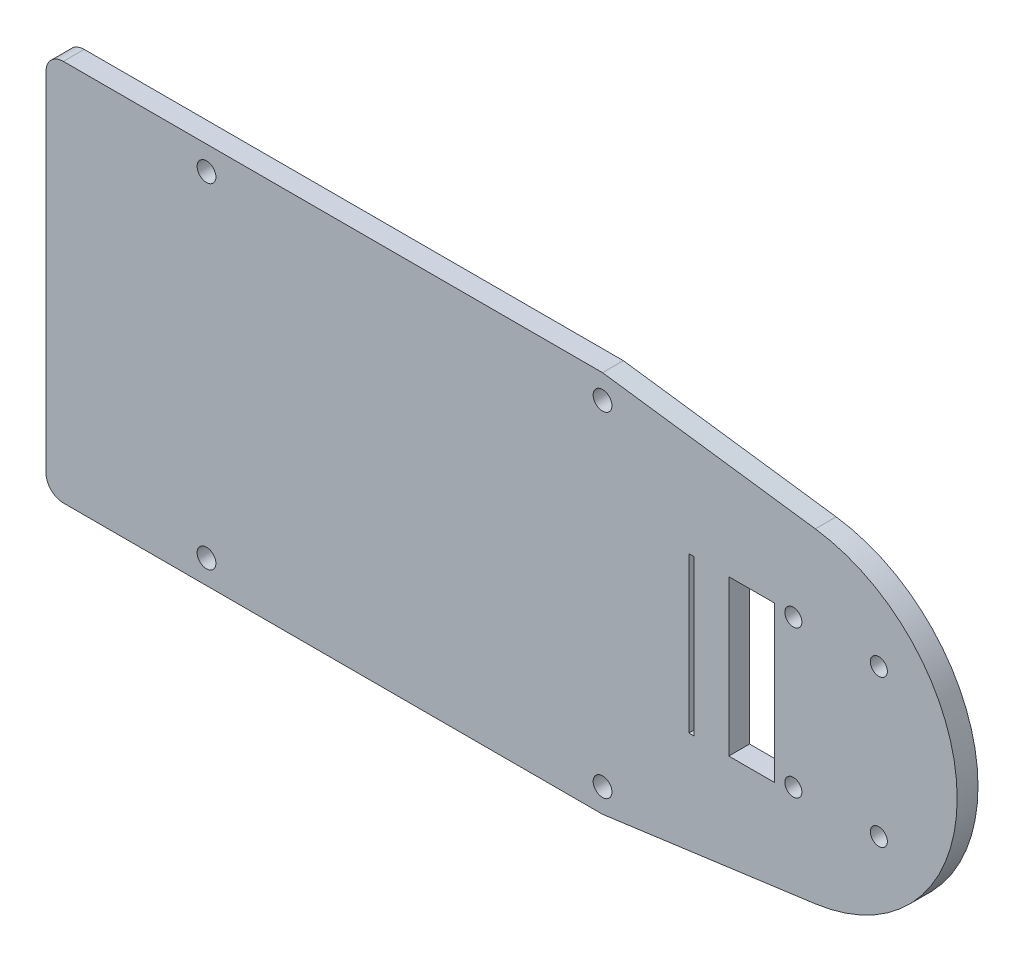
ISO-10303-21;
HEADER;
FILE_DESCRIPTION(('STEP AP214'),'2;1');
FILE_NAME('part.step','',(''),(''),'','','');
FILE_SCHEMA(('AUTOMOTIVE_DESIGN { 1 0 10303 214 1 1 1 1 }'));
ENDSEC;
DATA;
#1=APPLICATION_CONTEXT('core data for automotive mechanical design processes');
#2=APPLICATION_PROTOCOL_DEFINITION('international standard','automotive_design',2000,#1);
#3=PRODUCT_CONTEXT('',#1,'mechanical');
#4=PRODUCT('Part','Part','',(#3));
#5=PRODUCT_RELATED_PRODUCT_CATEGORY('part','',(#4));
#6=PRODUCT_DEFINITION_FORMATION('','',#4);
#7=PRODUCT_DEFINITION_CONTEXT('part definition',#1,'design');
#8=PRODUCT_DEFINITION('design','',#6,#7);
#9=PRODUCT_DEFINITION_SHAPE('','',#8);
#10=(LENGTH_UNIT() NAMED_UNIT(*) SI_UNIT(.MILLI.,.METRE.));
#11=(NAMED_UNIT(*) PLANE_ANGLE_UNIT() SI_UNIT($,.RADIAN.));
#12=(NAMED_UNIT(*) SI_UNIT($,.STERADIAN.) SOLID_ANGLE_UNIT());
#13=UNCERTAINTY_MEASURE_WITH_UNIT(LENGTH_MEASURE(1.E-05),#10,'distance_accuracy_value','');
#14=(GEOMETRIC_REPRESENTATION_CONTEXT(3) GLOBAL_UNCERTAINTY_ASSIGNED_CONTEXT((#13)) GLOBAL_UNIT_ASSIGNED_CONTEXT((#10,
#11,#12)) REPRESENTATION_CONTEXT('',''));
#15=CARTESIAN_POINT('',(0.,0.,0.));
#16=DIRECTION('',(0.,0.,1.));
#17=DIRECTION('',(1.,0.,0.));
#18=AXIS2_PLACEMENT_3D('',#15,#16,#17);
#19=CARTESIAN_POINT('',(0.41036367000002,-40.9796361,-3.048));
#20=DIRECTION('',(0.,-1.,0.));
#21=DIRECTION('',(1.,0.,0.));
#22=AXIS2_PLACEMENT_3D('',#19,#20,#21);
#23=PLANE('',#22);
#24=DIRECTION('',(0.,0.,-1.));
#25=VECTOR('',#24,1.);
#26=CARTESIAN_POINT('',(1.37500106000001,-40.9796371659265,0.));
#27=LINE('',#26,#25);
#28=CARTESIAN_POINT('',(1.37500106000001,-40.9796371659265,0.));
#29=VERTEX_POINT('',#28);
#30=CARTESIAN_POINT('',(1.37500106000001,-40.9796371659265,-3.048));
#31=VERTEX_POINT('',#30);
#32=EDGE_CURVE('E150',#29,#31,#27,.T.);
#33=ORIENTED_EDGE('',*,*,#32,.F.);
#34=DIRECTION('',(1.,0.,0.));
#35=VECTOR('',#34,1.);
#36=CARTESIAN_POINT('',(0.41036367000002,-40.9796361,0.));
#37=LINE('',#36,#35);
#38=CARTESIAN_POINT('',(-77.5896388057376,-40.9796371659265,0.));
#39=VERTEX_POINT('',#38);
#40=EDGE_CURVE('E36',#39,#29,#37,.T.);
#41=ORIENTED_EDGE('',*,*,#40,.F.);
#42=DIRECTION('',(0.,0.,1.));
#43=VECTOR('',#42,1.);
#44=CARTESIAN_POINT('',(-77.5896388057376,-40.9796371659265,-3.048));
#45=LINE('',#44,#43);
#46=CARTESIAN_POINT('',(-77.5896388057376,-40.9796371659265,-3.048));
#47=VERTEX_POINT('',#46);
#48=EDGE_CURVE('E265',#47,#39,#45,.T.);
#49=ORIENTED_EDGE('',*,*,#48,.F.);
#50=DIRECTION('',(1.,0.,0.));
#51=VECTOR('',#50,1.);
#52=CARTESIAN_POINT('',(0.41036367000002,-40.9796361,-3.048));
#53=LINE('',#52,#51);
#54=EDGE_CURVE('E11',#47,#31,#53,.T.);
#55=ORIENTED_EDGE('',*,*,#54,.T.);
#56=EDGE_LOOP('',(#33,#41,#49,#55));
#57=FACE_BOUND('',#56,.T.);
#58=ADVANCED_FACE('F32',(#57),#23,.T.);
#59=CARTESIAN_POINT('',(0.41036367000002,15.02963974,-3.048));
#60=DIRECTION('',(0.,1.,0.));
#61=DIRECTION('',(0.,0.,1.));
#62=AXIS2_PLACEMENT_3D('',#59,#60,#61);
#63=PLANE('',#62);
#64=DIRECTION('',(0.,0.,-1.));
#65=VECTOR('',#64,1.);
#66=CARTESIAN_POINT('',(1.37500106,15.02963974,0.));
#67=LINE('',#66,#65);
#68=CARTESIAN_POINT('',(1.37500106,15.02963974,0.));
#69=VERTEX_POINT('',#68);
#70=CARTESIAN_POINT('',(1.37500106,15.02963974,-3.048));
#71=VERTEX_POINT('',#70);
#72=EDGE_CURVE('E305',#69,#71,#67,.T.);
#73=ORIENTED_EDGE('',*,*,#72,.T.);
#74=DIRECTION('',(-1.,0.,0.));
#75=VECTOR('',#74,1.);
#76=CARTESIAN_POINT('',(0.41036367000002,15.02963974,-3.048));
#77=LINE('',#76,#75);
#78=CARTESIAN_POINT('',(-77.5896388057376,15.0296386740734,-3.048));
#79=VERTEX_POINT('',#78);
#80=EDGE_CURVE('E41',#71,#79,#77,.T.);
#81=ORIENTED_EDGE('',*,*,#80,.T.);
#82=DIRECTION('',(0.,0.,1.));
#83=VECTOR('',#82,1.);
#84=CARTESIAN_POINT('',(-77.5896388057376,15.0296386740734,-3.048));
#85=LINE('',#84,#83);
#86=CARTESIAN_POINT('',(-77.5896388057376,15.0296386740734,0.));
#87=VERTEX_POINT('',#86);
#88=EDGE_CURVE('E274',#79,#87,#85,.T.);
#89=ORIENTED_EDGE('',*,*,#88,.T.);
#90=DIRECTION('',(-1.,0.,0.));
#91=VECTOR('',#90,1.);
#92=CARTESIAN_POINT('',(0.41036367000002,15.02963974,0.));
#93=LINE('',#92,#91);
#94=EDGE_CURVE('E168',#69,#87,#93,.T.);
#95=ORIENTED_EDGE('',*,*,#94,.F.);
#96=EDGE_LOOP('',(#73,#81,#89,#95));
#97=FACE_BOUND('',#96,.T.);
#98=ADVANCED_FACE('F34',(#97),#63,.T.);
#99=CARTESIAN_POINT('',(60.10036367,12.48963974,-3.048));
#100=DIRECTION('',(0.,0.,-1.));
#101=DIRECTION('',(-1.,0.,0.));
#102=AXIS2_PLACEMENT_3D('',#99,#100,#101);
#103=PLANE('',#102);
#104=DIRECTION('',(-0.990940508383682,0.134301559351667,0.));
#105=VECTOR('',#104,1.);
#106=CARTESIAN_POINT('',(1.37500106,15.02963974,-3.048));
#107=LINE('',#106,#105);
#108=CARTESIAN_POINT('',(32.5382552743755,10.8061030089306,-3.048));
#109=VERTEX_POINT('',#108);
#110=EDGE_CURVE('E155',#109,#71,#107,.T.);
#111=ORIENTED_EDGE('',*,*,#110,.F.);
#112=CARTESIAN_POINT('',(29.3151521514949,-12.9754782517694,-3.048));
#113=DIRECTION('',(0.,0.,1.));
#114=DIRECTION('',(1.,0.,0.));
#115=AXIS2_PLACEMENT_3D('',#112,#113,#114);
#116=CIRCLE('',#115,23.999);
#117=CARTESIAN_POINT('',(32.5375365629992,-36.7571569079218,-3.048));
#118=VERTEX_POINT('',#117);
#119=EDGE_CURVE('E314',#118,#109,#116,.T.);
#120=ORIENTED_EDGE('',*,*,#119,.F.);
#121=DIRECTION('',(0.990944566696628,0.134271611796508,0.));
#122=VECTOR('',#121,1.);
#123=CARTESIAN_POINT('',(1.37500106000001,-40.9796371659265,-3.048));
#124=LINE('',#123,#122);
#125=EDGE_CURVE('E317',#31,#118,#124,.T.);
#126=ORIENTED_EDGE('',*,*,#125,.F.);
#127=ORIENTED_EDGE('',*,*,#54,.F.);
#128=CARTESIAN_POINT('',(-77.5896388057376,-38.4396371659265,-3.048));
#129=DIRECTION('',(0.,0.,1.));
#130=DIRECTION('',(1.,0.,0.));
#131=AXIS2_PLACEMENT_3D('',#128,#129,#130);
#132=CIRCLE('',#131,2.54000000000001);
#133=CARTESIAN_POINT('',(-80.1296388057376,-38.4396371659265,-3.048));
#134=VERTEX_POINT('',#133);
#135=EDGE_CURVE('E277',#134,#47,#132,.T.);
#136=ORIENTED_EDGE('',*,*,#135,.F.);
#137=DIRECTION('',(0.,-1.,0.));
#138=VECTOR('',#137,1.);
#139=CARTESIAN_POINT('',(-80.1296388057376,12.4896386740734,-3.048));
#140=LINE('',#139,#138);
#141=CARTESIAN_POINT('',(-80.1296388057376,12.4896386740734,-3.048));
#142=VERTEX_POINT('',#141);
#143=EDGE_CURVE('E291',#142,#134,#140,.T.);
#144=ORIENTED_EDGE('',*,*,#143,.F.);
#145=CARTESIAN_POINT('',(-77.5896388057376,12.4896386740734,-3.048));
#146=DIRECTION('',(0.,0.,1.));
#147=DIRECTION('',(1.,0.,0.));
#148=AXIS2_PLACEMENT_3D('',#145,#146,#147);
#149=CIRCLE('',#148,2.54000000000001);
#150=EDGE_CURVE('E283',#79,#142,#149,.T.);
#151=ORIENTED_EDGE('',*,*,#150,.F.);
#152=ORIENTED_EDGE('',*,*,#80,.F.);
#153=EDGE_LOOP('',(#111,#120,#126,#127,#136,#144,#151,#152));
#154=FACE_BOUND('',#153,.T.);
#155=DIRECTION('',(0.,1.,0.));
#156=VECTOR('',#155,1.);
#157=CARTESIAN_POINT('',(14.7802521514949,-24.35209818,-3.048));
#158=LINE('',#157,#156);
#159=CARTESIAN_POINT('',(14.7802521514949,-24.35209818,-3.048));
#160=VERTEX_POINT('',#159);
#161=CARTESIAN_POINT('',(14.7802521514949,-1.59789817999999,-3.048));
#162=VERTEX_POINT('',#161);
#163=EDGE_CURVE('E256',#160,#162,#158,.T.);
#164=ORIENTED_EDGE('',*,*,#163,.T.);
#165=DIRECTION('',(-1.,0.,0.));
#166=VECTOR('',#165,1.);
#167=CARTESIAN_POINT('',(14.0182521514949,-1.59789817999999,-3.048));
#168=LINE('',#167,#166);
#169=CARTESIAN_POINT('',(14.0182521514949,-1.59789817999999,-3.048));
#170=VERTEX_POINT('',#169);
#171=EDGE_CURVE('E269',#162,#170,#168,.T.);
#172=ORIENTED_EDGE('',*,*,#171,.T.);
#173=DIRECTION('',(0.,-1.,0.));
#174=VECTOR('',#173,1.);
#175=CARTESIAN_POINT('',(14.0182521514949,-24.35209818,-3.048));
#176=LINE('',#175,#174);
#177=CARTESIAN_POINT('',(14.0182521514949,-24.35209818,-3.048));
#178=VERTEX_POINT('',#177);
#179=EDGE_CURVE('E57',#170,#178,#176,.T.);
#180=ORIENTED_EDGE('',*,*,#179,.T.);
#181=DIRECTION('',(1.,0.,0.));
#182=VECTOR('',#181,1.);
#183=CARTESIAN_POINT('',(14.0182521514949,-24.35209818,-3.048));
#184=LINE('',#183,#182);
#185=EDGE_CURVE('E248',#178,#160,#184,.T.);
#186=ORIENTED_EDGE('',*,*,#185,.T.);
#187=EDGE_LOOP('',(#164,#172,#180,#186));
#188=FACE_BOUND('',#187,.T.);
#189=CARTESIAN_POINT('',(29.3151521514949,-23.57459818,-3.048));
#190=DIRECTION('',(0.,0.,1.));
#191=DIRECTION('',(1.,0.,0.));
#192=AXIS2_PLACEMENT_3D('',#189,#190,#191);
#193=CIRCLE('',#192,1.24999999999997);
#194=CARTESIAN_POINT('',(30.5651521514948,-23.57459818,-3.048));
#195=VERTEX_POINT('',#194);
#196=EDGE_CURVE('E235',#195,#195,#193,.T.);
#197=ORIENTED_EDGE('',*,*,#196,.T.);
#198=EDGE_LOOP('',(#197));
#199=FACE_BOUND('',#198,.T.);
#200=CARTESIAN_POINT('',(41.8387521514949,-23.57459818,-3.048));
#201=DIRECTION('',(0.,0.,1.));
#202=DIRECTION('',(1.,0.,0.));
#203=AXIS2_PLACEMENT_3D('',#200,#201,#202);
#204=CIRCLE('',#203,1.24999999999997);
#205=CARTESIAN_POINT('',(43.0887521514948,-23.57459818,-3.048));
#206=VERTEX_POINT('',#205);
#207=EDGE_CURVE('E229',#206,#206,#204,.T.);
#208=ORIENTED_EDGE('',*,*,#207,.T.);
#209=EDGE_LOOP('',(#208));
#210=FACE_BOUND('',#209,.T.);
#211=CARTESIAN_POINT('',(41.8387521514949,-2.00169817999996,-3.048));
#212=DIRECTION('',(0.,0.,1.));
#213=DIRECTION('',(1.,0.,0.));
#214=AXIS2_PLACEMENT_3D('',#211,#212,#213);
#215=CIRCLE('',#214,1.24999999999997);
#216=CARTESIAN_POINT('',(43.0887521514948,-2.00169817999996,-3.048));
#217=VERTEX_POINT('',#216);
#218=EDGE_CURVE('E223',#217,#217,#215,.T.);
#219=ORIENTED_EDGE('',*,*,#218,.T.);
#220=EDGE_LOOP('',(#219));
#221=FACE_BOUND('',#220,.T.);
#222=CARTESIAN_POINT('',(29.3151521514949,-2.00169817999996,-3.048));
#223=DIRECTION('',(0.,0.,1.));
#224=DIRECTION('',(1.,0.,0.));
#225=AXIS2_PLACEMENT_3D('',#222,#223,#224);
#226=CIRCLE('',#225,1.24999999999997);
#227=CARTESIAN_POINT('',(30.5651521514948,-2.00169817999996,-3.048));
#228=VERTEX_POINT('',#227);
#229=EDGE_CURVE('E209',#228,#228,#226,.T.);
#230=ORIENTED_EDGE('',*,*,#229,.T.);
#231=EDGE_LOOP('',(#230));
#232=FACE_BOUND('',#231,.T.);
#233=DIRECTION('',(0.,-1.,0.));
#234=VECTOR('',#233,1.);
#235=CARTESIAN_POINT('',(19.8602521514949,-24.35209818,-3.048));
#236=LINE('',#235,#234);
#237=CARTESIAN_POINT('',(19.8602521514949,-1.59789818,-3.048));
#238=VERTEX_POINT('',#237);
#239=CARTESIAN_POINT('',(19.8602521514949,-24.35209818,-3.048));
#240=VERTEX_POINT('',#239);
#241=EDGE_CURVE('E200',#238,#240,#236,.T.);
#242=ORIENTED_EDGE('',*,*,#241,.T.);
#243=DIRECTION('',(1.,0.,0.));
#244=VECTOR('',#243,1.);
#245=CARTESIAN_POINT('',(19.8602521514949,-24.35209818,-3.048));
#246=LINE('',#245,#244);
#247=CARTESIAN_POINT('',(26.5602521514949,-24.35209818,-3.048));
#248=VERTEX_POINT('',#247);
#249=EDGE_CURVE('E215',#240,#248,#246,.T.);
#250=ORIENTED_EDGE('',*,*,#249,.T.);
#251=DIRECTION('',(0.,1.,0.));
#252=VECTOR('',#251,1.);
#253=CARTESIAN_POINT('',(26.5602521514949,-24.35209818,-3.048));
#254=LINE('',#253,#252);
#255=CARTESIAN_POINT('',(26.5602521514949,-1.59789818000002,-3.048));
#256=VERTEX_POINT('',#255);
#257=EDGE_CURVE('E212',#248,#256,#254,.T.);
#258=ORIENTED_EDGE('',*,*,#257,.T.);
#259=DIRECTION('',(-1.,0.,0.));
#260=VECTOR('',#259,1.);
#261=CARTESIAN_POINT('',(19.8602521514949,-1.59789818,-3.048));
#262=LINE('',#261,#260);
#263=EDGE_CURVE('E192',#256,#238,#262,.T.);
#264=ORIENTED_EDGE('',*,*,#263,.T.);
#265=EDGE_LOOP('',(#242,#250,#258,#264));
#266=FACE_BOUND('',#265,.T.);
#267=CARTESIAN_POINT('',(1.37500106,11.52500108,-3.048));
#268=DIRECTION('',(0.,0.,1.));
#269=DIRECTION('',(1.,0.,0.));
#270=AXIS2_PLACEMENT_3D('',#267,#268,#269);
#271=CIRCLE('',#270,1.37499852);
#272=CARTESIAN_POINT('',(2.74999958,11.52500108,-3.048));
#273=VERTEX_POINT('',#272);
#274=EDGE_CURVE('E170',#273,#273,#271,.T.);
#275=ORIENTED_EDGE('',*,*,#274,.T.);
#276=EDGE_LOOP('',(#275));
#277=FACE_BOUND('',#276,.T.);
#278=CARTESIAN_POINT('',(1.37500106,-37.47499998,-3.048));
#279=DIRECTION('',(0.,0.,1.));
#280=DIRECTION('',(1.,0.,0.));
#281=AXIS2_PLACEMENT_3D('',#278,#279,#280);
#282=CIRCLE('',#281,1.37499852);
#283=CARTESIAN_POINT('',(2.74999958,-37.47499998,-3.048));
#284=VERTEX_POINT('',#283);
#285=EDGE_CURVE('E180',#284,#284,#282,.T.);
#286=ORIENTED_EDGE('',*,*,#285,.T.);
#287=EDGE_LOOP('',(#286));
#288=FACE_BOUND('',#287,.T.);
#289=CARTESIAN_POINT('',(-56.62499978,11.52500108,-3.048));
#290=DIRECTION('',(0.,0.,1.));
#291=DIRECTION('',(-1.,0.,0.));
#292=AXIS2_PLACEMENT_3D('',#289,#290,#291);
#293=CIRCLE('',#292,1.37499852);
#294=CARTESIAN_POINT('',(-57.9999983,11.52500108,-3.048));
#295=VERTEX_POINT('',#294);
#296=EDGE_CURVE('E299',#295,#295,#293,.T.);
#297=ORIENTED_EDGE('',*,*,#296,.T.);
#298=EDGE_LOOP('',(#297));
#299=FACE_BOUND('',#298,.T.);
#300=CARTESIAN_POINT('',(-56.62499978,-37.47499998,-3.048));
#301=DIRECTION('',(0.,0.,1.));
#302=DIRECTION('',(-1.,0.,0.));
#303=AXIS2_PLACEMENT_3D('',#300,#301,#302);
#304=CIRCLE('',#303,1.37499852);
#305=CARTESIAN_POINT('',(-57.9999983,-37.47499998,-3.048));
#306=VERTEX_POINT('',#305);
#307=EDGE_CURVE('E288',#306,#306,#304,.T.);
#308=ORIENTED_EDGE('',*,*,#307,.T.);
#309=EDGE_LOOP('',(#308));
#310=FACE_BOUND('',#309,.T.);
#311=ADVANCED_FACE('F338',(#154,#188,#199,#210,#221,#232,#266,#277,#288,#299,#310),#103,.T.);
#312=CARTESIAN_POINT('',(60.10036367,12.48963974,0.));
#313=DIRECTION('',(0.,0.,-1.));
#314=DIRECTION('',(-1.,0.,0.));
#315=AXIS2_PLACEMENT_3D('',#312,#313,#314);
#316=PLANE('',#315);
#317=CARTESIAN_POINT('',(29.3151521514949,-12.9754782517694,0.));
#318=DIRECTION('',(0.,0.,1.));
#319=DIRECTION('',(1.,0.,0.));
#320=AXIS2_PLACEMENT_3D('',#317,#318,#319);
#321=CIRCLE('',#320,23.999);
#322=CARTESIAN_POINT('',(32.5375365629992,-36.7571569079218,0.));
#323=VERTEX_POINT('',#322);
#324=CARTESIAN_POINT('',(32.5382552743755,10.8061030089306,0.));
#325=VERTEX_POINT('',#324);
#326=EDGE_CURVE('E49',#323,#325,#321,.T.);
#327=ORIENTED_EDGE('',*,*,#326,.T.);
#328=DIRECTION('',(-0.990940508383682,0.134301559351667,0.));
#329=VECTOR('',#328,1.);
#330=CARTESIAN_POINT('',(1.37500106,15.02963974,0.));
#331=LINE('',#330,#329);
#332=EDGE_CURVE('E160',#325,#69,#331,.T.);
#333=ORIENTED_EDGE('',*,*,#332,.T.);
#334=ORIENTED_EDGE('',*,*,#94,.T.);
#335=CARTESIAN_POINT('',(-77.5896388057376,12.4896386740734,0.));
#336=DIRECTION('',(0.,0.,1.));
#337=DIRECTION('',(1.,0.,0.));
#338=AXIS2_PLACEMENT_3D('',#335,#336,#337);
#339=CIRCLE('',#338,2.54000000000001);
#340=CARTESIAN_POINT('',(-80.1296388057376,12.4896386740734,0.));
#341=VERTEX_POINT('',#340);
#342=EDGE_CURVE('E286',#87,#341,#339,.T.);
#343=ORIENTED_EDGE('',*,*,#342,.T.);
#344=DIRECTION('',(0.,-1.,0.));
#345=VECTOR('',#344,1.);
#346=CARTESIAN_POINT('',(-80.1296388057376,12.4896386740734,0.));
#347=LINE('',#346,#345);
#348=CARTESIAN_POINT('',(-80.1296388057376,-38.4396371659265,0.));
#349=VERTEX_POINT('',#348);
#350=EDGE_CURVE('E284',#341,#349,#347,.T.);
#351=ORIENTED_EDGE('',*,*,#350,.T.);
#352=CARTESIAN_POINT('',(-77.5896388057376,-38.4396371659265,0.));
#353=DIRECTION('',(0.,0.,1.));
#354=DIRECTION('',(1.,0.,0.));
#355=AXIS2_PLACEMENT_3D('',#352,#353,#354);
#356=CIRCLE('',#355,2.54000000000001);
#357=EDGE_CURVE('E167',#349,#39,#356,.T.);
#358=ORIENTED_EDGE('',*,*,#357,.T.);
#359=ORIENTED_EDGE('',*,*,#40,.T.);
#360=DIRECTION('',(0.990944566696628,0.134271611796508,0.));
#361=VECTOR('',#360,1.);
#362=CARTESIAN_POINT('',(1.37500106000001,-40.9796371659265,0.));
#363=LINE('',#362,#361);
#364=EDGE_CURVE('E146',#29,#323,#363,.T.);
#365=ORIENTED_EDGE('',*,*,#364,.T.);
#366=EDGE_LOOP('',(#327,#333,#334,#343,#351,#358,#359,#365));
#367=FACE_BOUND('',#366,.T.);
#368=DIRECTION('',(-1.,0.,0.));
#369=VECTOR('',#368,1.);
#370=CARTESIAN_POINT('',(14.0182521514949,-1.59789817999999,0.));
#371=LINE('',#370,#369);
#372=CARTESIAN_POINT('',(14.7802521514949,-1.59789817999999,0.));
#373=VERTEX_POINT('',#372);
#374=CARTESIAN_POINT('',(14.0182521514949,-1.59789817999999,0.));
#375=VERTEX_POINT('',#374);
#376=EDGE_CURVE('E260',#373,#375,#371,.T.);
#377=ORIENTED_EDGE('',*,*,#376,.F.);
#378=DIRECTION('',(0.,1.,0.));
#379=VECTOR('',#378,1.);
#380=CARTESIAN_POINT('',(14.7802521514949,-24.35209818,0.));
#381=LINE('',#380,#379);
#382=CARTESIAN_POINT('',(14.7802521514949,-24.35209818,0.));
#383=VERTEX_POINT('',#382);
#384=EDGE_CURVE('E263',#383,#373,#381,.T.);
#385=ORIENTED_EDGE('',*,*,#384,.F.);
#386=DIRECTION('',(1.,0.,0.));
#387=VECTOR('',#386,1.);
#388=CARTESIAN_POINT('',(14.0182521514949,-24.35209818,0.));
#389=LINE('',#388,#387);
#390=CARTESIAN_POINT('',(14.0182521514949,-24.35209818,0.));
#391=VERTEX_POINT('',#390);
#392=EDGE_CURVE('E253',#391,#383,#389,.T.);
#393=ORIENTED_EDGE('',*,*,#392,.F.);
#394=DIRECTION('',(0.,-1.,0.));
#395=VECTOR('',#394,1.);
#396=CARTESIAN_POINT('',(14.0182521514949,-24.35209818,0.));
#397=LINE('',#396,#395);
#398=EDGE_CURVE('E257',#375,#391,#397,.T.);
#399=ORIENTED_EDGE('',*,*,#398,.F.);
#400=EDGE_LOOP('',(#377,#385,#393,#399));
#401=FACE_BOUND('',#400,.T.);
#402=CARTESIAN_POINT('',(29.3151521514949,-23.57459818,0.));
#403=DIRECTION('',(0.,0.,1.));
#404=DIRECTION('',(1.,0.,0.));
#405=AXIS2_PLACEMENT_3D('',#402,#403,#404);
#406=CIRCLE('',#405,1.24999999999997);
#407=CARTESIAN_POINT('',(30.5651521514948,-23.57459818,0.));
#408=VERTEX_POINT('',#407);
#409=EDGE_CURVE('E238',#408,#408,#406,.T.);
#410=ORIENTED_EDGE('',*,*,#409,.F.);
#411=EDGE_LOOP('',(#410));
#412=FACE_BOUND('',#411,.T.);
#413=CARTESIAN_POINT('',(41.8387521514949,-23.57459818,0.));
#414=DIRECTION('',(0.,0.,1.));
#415=DIRECTION('',(1.,0.,0.));
#416=AXIS2_PLACEMENT_3D('',#413,#414,#415);
#417=CIRCLE('',#416,1.24999999999997);
#418=CARTESIAN_POINT('',(43.0887521514948,-23.57459818,0.));
#419=VERTEX_POINT('',#418);
#420=EDGE_CURVE('E232',#419,#419,#417,.T.);
#421=ORIENTED_EDGE('',*,*,#420,.F.);
#422=EDGE_LOOP('',(#421));
#423=FACE_BOUND('',#422,.T.);
#424=CARTESIAN_POINT('',(41.8387521514949,-2.00169817999996,0.));
#425=DIRECTION('',(0.,0.,1.));
#426=DIRECTION('',(1.,0.,0.));
#427=AXIS2_PLACEMENT_3D('',#424,#425,#426);
#428=CIRCLE('',#427,1.24999999999997);
#429=CARTESIAN_POINT('',(43.0887521514948,-2.00169817999996,0.));
#430=VERTEX_POINT('',#429);
#431=EDGE_CURVE('E226',#430,#430,#428,.T.);
#432=ORIENTED_EDGE('',*,*,#431,.F.);
#433=EDGE_LOOP('',(#432));
#434=FACE_BOUND('',#433,.T.);
#435=CARTESIAN_POINT('',(29.3151521514949,-2.00169817999996,0.));
#436=DIRECTION('',(0.,0.,1.));
#437=DIRECTION('',(1.,0.,0.));
#438=AXIS2_PLACEMENT_3D('',#435,#436,#437);
#439=CIRCLE('',#438,1.24999999999997);
#440=CARTESIAN_POINT('',(30.5651521514948,-2.00169817999996,0.));
#441=VERTEX_POINT('',#440);
#442=EDGE_CURVE('E220',#441,#441,#439,.T.);
#443=ORIENTED_EDGE('',*,*,#442,.F.);
#444=EDGE_LOOP('',(#443));
#445=FACE_BOUND('',#444,.T.);
#446=DIRECTION('',(1.,0.,0.));
#447=VECTOR('',#446,1.);
#448=CARTESIAN_POINT('',(19.8602521514949,-24.35209818,0.));
#449=LINE('',#448,#447);
#450=CARTESIAN_POINT('',(19.8602521514949,-24.35209818,0.));
#451=VERTEX_POINT('',#450);
#452=CARTESIAN_POINT('',(26.5602521514949,-24.35209818,0.));
#453=VERTEX_POINT('',#452);
#454=EDGE_CURVE('E204',#451,#453,#449,.T.);
#455=ORIENTED_EDGE('',*,*,#454,.F.);
#456=DIRECTION('',(0.,-1.,0.));
#457=VECTOR('',#456,1.);
#458=CARTESIAN_POINT('',(19.8602521514949,-24.35209818,0.));
#459=LINE('',#458,#457);
#460=CARTESIAN_POINT('',(19.8602521514949,-1.59789818,0.));
#461=VERTEX_POINT('',#460);
#462=EDGE_CURVE('E207',#461,#451,#459,.T.);
#463=ORIENTED_EDGE('',*,*,#462,.F.);
#464=DIRECTION('',(-1.,0.,0.));
#465=VECTOR('',#464,1.);
#466=CARTESIAN_POINT('',(19.8602521514949,-1.59789818,0.));
#467=LINE('',#466,#465);
#468=CARTESIAN_POINT('',(26.5602521514949,-1.59789818000002,0.));
#469=VERTEX_POINT('',#468);
#470=EDGE_CURVE('E197',#469,#461,#467,.T.);
#471=ORIENTED_EDGE('',*,*,#470,.F.);
#472=DIRECTION('',(0.,1.,0.));
#473=VECTOR('',#472,1.);
#474=CARTESIAN_POINT('',(26.5602521514949,-24.35209818,0.));
#475=LINE('',#474,#473);
#476=EDGE_CURVE('E201',#453,#469,#475,.T.);
#477=ORIENTED_EDGE('',*,*,#476,.F.);
#478=EDGE_LOOP('',(#455,#463,#471,#477));
#479=FACE_BOUND('',#478,.T.);
#480=CARTESIAN_POINT('',(1.37500106,11.52500108,0.));
#481=DIRECTION('',(0.,0.,1.));
#482=DIRECTION('',(1.,0.,0.));
#483=AXIS2_PLACEMENT_3D('',#480,#481,#482);
#484=CIRCLE('',#483,1.37499852);
#485=CARTESIAN_POINT('',(2.74999958,11.52500108,0.));
#486=VERTEX_POINT('',#485);
#487=EDGE_CURVE('E176',#486,#486,#484,.T.);
#488=ORIENTED_EDGE('',*,*,#487,.F.);
#489=EDGE_LOOP('',(#488));
#490=FACE_BOUND('',#489,.T.);
#491=CARTESIAN_POINT('',(1.37500106,-37.47499998,0.));
#492=DIRECTION('',(0.,0.,1.));
#493=DIRECTION('',(1.,0.,0.));
#494=AXIS2_PLACEMENT_3D('',#491,#492,#493);
#495=CIRCLE('',#494,1.37499852);
#496=CARTESIAN_POINT('',(2.74999958,-37.47499998,0.));
#497=VERTEX_POINT('',#496);
#498=EDGE_CURVE('E182',#497,#497,#495,.T.);
#499=ORIENTED_EDGE('',*,*,#498,.F.);
#500=EDGE_LOOP('',(#499));
#501=FACE_BOUND('',#500,.T.);
#502=CARTESIAN_POINT('',(-56.62499978,11.52500108,0.));
#503=DIRECTION('',(0.,0.,1.));
#504=DIRECTION('',(-1.,0.,0.));
#505=AXIS2_PLACEMENT_3D('',#502,#503,#504);
#506=CIRCLE('',#505,1.37499852);
#507=CARTESIAN_POINT('',(-57.9999983,11.52500108,0.));
#508=VERTEX_POINT('',#507);
#509=EDGE_CURVE('E302',#508,#508,#506,.T.);
#510=ORIENTED_EDGE('',*,*,#509,.F.);
#511=EDGE_LOOP('',(#510));
#512=FACE_BOUND('',#511,.T.);
#513=CARTESIAN_POINT('',(-56.62499978,-37.47499998,0.));
#514=DIRECTION('',(0.,0.,1.));
#515=DIRECTION('',(-1.,0.,0.));
#516=AXIS2_PLACEMENT_3D('',#513,#514,#515);
#517=CIRCLE('',#516,1.37499852);
#518=CARTESIAN_POINT('',(-57.9999983,-37.47499998,0.));
#519=VERTEX_POINT('',#518);
#520=EDGE_CURVE('E296',#519,#519,#517,.T.);
#521=ORIENTED_EDGE('',*,*,#520,.F.);
#522=EDGE_LOOP('',(#521));
#523=FACE_BOUND('',#522,.T.);
#524=ADVANCED_FACE('F163',(#367,#401,#412,#423,#434,#445,#479,#490,#501,#512,#523),#316,.F.);
#525=CARTESIAN_POINT('',(1.37500106,11.52500108,-3.048));
#526=DIRECTION('',(0.,0.,1.));
#527=DIRECTION('',(1.,0.,0.));
#528=AXIS2_PLACEMENT_3D('',#525,#526,#527);
#529=CYLINDRICAL_SURFACE('',#528,1.37499852);
#530=ORIENTED_EDGE('',*,*,#274,.F.);
#531=EDGE_LOOP('',(#530));
#532=FACE_BOUND('',#531,.T.);
#533=ORIENTED_EDGE('',*,*,#487,.T.);
#534=EDGE_LOOP('',(#533));
#535=FACE_BOUND('',#534,.T.);
#536=ADVANCED_FACE('F362',(#532,#535),#529,.F.);
#537=CARTESIAN_POINT('',(1.37500106,-37.47499998,-3.048));
#538=DIRECTION('',(0.,0.,1.));
#539=DIRECTION('',(1.,0.,0.));
#540=AXIS2_PLACEMENT_3D('',#537,#538,#539);
#541=CYLINDRICAL_SURFACE('',#540,1.37499852);
#542=ORIENTED_EDGE('',*,*,#285,.F.);
#543=EDGE_LOOP('',(#542));
#544=FACE_BOUND('',#543,.T.);
#545=ORIENTED_EDGE('',*,*,#498,.T.);
#546=EDGE_LOOP('',(#545));
#547=FACE_BOUND('',#546,.T.);
#548=ADVANCED_FACE('F367',(#544,#547),#541,.F.);
#549=CARTESIAN_POINT('',(19.8602521514949,-24.35209818,-3.048));
#550=DIRECTION('',(-1.,0.,0.));
#551=DIRECTION('',(0.,0.,1.));
#552=AXIS2_PLACEMENT_3D('',#549,#550,#551);
#553=PLANE('',#552);
#554=ORIENTED_EDGE('',*,*,#462,.T.);
#555=DIRECTION('',(0.,0.,1.));
#556=VECTOR('',#555,1.);
#557=CARTESIAN_POINT('',(19.8602521514949,-24.35209818,-3.048));
#558=LINE('',#557,#556);
#559=EDGE_CURVE('E188',#240,#451,#558,.T.);
#560=ORIENTED_EDGE('',*,*,#559,.F.);
#561=ORIENTED_EDGE('',*,*,#241,.F.);
#562=DIRECTION('',(0.,0.,1.));
#563=VECTOR('',#562,1.);
#564=CARTESIAN_POINT('',(19.8602521514949,-1.59789818,-3.048));
#565=LINE('',#564,#563);
#566=EDGE_CURVE('E185',#238,#461,#565,.T.);
#567=ORIENTED_EDGE('',*,*,#566,.T.);
#568=EDGE_LOOP('',(#554,#560,#561,#567));
#569=FACE_BOUND('',#568,.T.);
#570=ADVANCED_FACE('F371',(#569),#553,.F.);
#571=CARTESIAN_POINT('',(19.8602521514949,-1.59789818,-3.048));
#572=DIRECTION('',(0.,1.,0.));
#573=DIRECTION('',(-1.,0.,0.));
#574=AXIS2_PLACEMENT_3D('',#571,#572,#573);
#575=PLANE('',#574);
#576=ORIENTED_EDGE('',*,*,#470,.T.);
#577=ORIENTED_EDGE('',*,*,#566,.F.);
#578=ORIENTED_EDGE('',*,*,#263,.F.);
#579=DIRECTION('',(0.,0.,1.));
#580=VECTOR('',#579,1.);
#581=CARTESIAN_POINT('',(26.5602521514949,-1.59789818000002,-3.048));
#582=LINE('',#581,#580);
#583=EDGE_CURVE('E194',#256,#469,#582,.T.);
#584=ORIENTED_EDGE('',*,*,#583,.T.);
#585=EDGE_LOOP('',(#576,#577,#578,#584));
#586=FACE_BOUND('',#585,.T.);
#587=ADVANCED_FACE('F375',(#586),#575,.F.);
#588=CARTESIAN_POINT('',(26.5602521514949,-24.35209818,-3.048));
#589=DIRECTION('',(1.,0.,0.));
#590=DIRECTION('',(0.,0.,-1.));
#591=AXIS2_PLACEMENT_3D('',#588,#589,#590);
#592=PLANE('',#591);
#593=ORIENTED_EDGE('',*,*,#476,.T.);
#594=ORIENTED_EDGE('',*,*,#583,.F.);
#595=ORIENTED_EDGE('',*,*,#257,.F.);
#596=DIRECTION('',(0.,0.,1.));
#597=VECTOR('',#596,1.);
#598=CARTESIAN_POINT('',(26.5602521514949,-24.35209818,-3.048));
#599=LINE('',#598,#597);
#600=EDGE_CURVE('E191',#248,#453,#599,.T.);
#601=ORIENTED_EDGE('',*,*,#600,.T.);
#602=EDGE_LOOP('',(#593,#594,#595,#601));
#603=FACE_BOUND('',#602,.T.);
#604=ADVANCED_FACE('F381',(#603),#592,.F.);
#605=CARTESIAN_POINT('',(19.8602521514949,-24.35209818,-3.048));
#606=DIRECTION('',(0.,-1.,0.));
#607=DIRECTION('',(0.,0.,-1.));
#608=AXIS2_PLACEMENT_3D('',#605,#606,#607);
#609=PLANE('',#608);
#610=ORIENTED_EDGE('',*,*,#454,.T.);
#611=ORIENTED_EDGE('',*,*,#600,.F.);
#612=ORIENTED_EDGE('',*,*,#249,.F.);
#613=ORIENTED_EDGE('',*,*,#559,.T.);
#614=EDGE_LOOP('',(#610,#611,#612,#613));
#615=FACE_BOUND('',#614,.T.);
#616=ADVANCED_FACE('F377',(#615),#609,.F.);
#617=CARTESIAN_POINT('',(29.3151521514949,-2.00169817999996,-3.048));
#618=DIRECTION('',(0.,0.,1.));
#619=DIRECTION('',(1.,0.,0.));
#620=AXIS2_PLACEMENT_3D('',#617,#618,#619);
#621=CYLINDRICAL_SURFACE('',#620,1.24999999999997);
#622=ORIENTED_EDGE('',*,*,#229,.F.);
#623=EDGE_LOOP('',(#622));
#624=FACE_BOUND('',#623,.T.);
#625=ORIENTED_EDGE('',*,*,#442,.T.);
#626=EDGE_LOOP('',(#625));
#627=FACE_BOUND('',#626,.T.);
#628=ADVANCED_FACE('F380',(#624,#627),#621,.F.);
#629=CARTESIAN_POINT('',(41.8387521514949,-2.00169817999996,-3.048));
#630=DIRECTION('',(0.,0.,1.));
#631=DIRECTION('',(1.,0.,0.));
#632=AXIS2_PLACEMENT_3D('',#629,#630,#631);
#633=CYLINDRICAL_SURFACE('',#632,1.24999999999997);
#634=ORIENTED_EDGE('',*,*,#218,.F.);
#635=EDGE_LOOP('',(#634));
#636=FACE_BOUND('',#635,.T.);
#637=ORIENTED_EDGE('',*,*,#431,.T.);
#638=EDGE_LOOP('',(#637));
#639=FACE_BOUND('',#638,.T.);
#640=ADVANCED_FACE('F391',(#636,#639),#633,.F.);
#641=CARTESIAN_POINT('',(41.8387521514949,-23.57459818,-3.048));
#642=DIRECTION('',(0.,0.,1.));
#643=DIRECTION('',(1.,0.,0.));
#644=AXIS2_PLACEMENT_3D('',#641,#642,#643);
#645=CYLINDRICAL_SURFACE('',#644,1.24999999999997);
#646=ORIENTED_EDGE('',*,*,#207,.F.);
#647=EDGE_LOOP('',(#646));
#648=FACE_BOUND('',#647,.T.);
#649=ORIENTED_EDGE('',*,*,#420,.T.);
#650=EDGE_LOOP('',(#649));
#651=FACE_BOUND('',#650,.T.);
#652=ADVANCED_FACE('F395',(#648,#651),#645,.F.);
#653=CARTESIAN_POINT('',(29.3151521514949,-23.57459818,-3.048));
#654=DIRECTION('',(0.,0.,1.));
#655=DIRECTION('',(1.,0.,0.));
#656=AXIS2_PLACEMENT_3D('',#653,#654,#655);
#657=CYLINDRICAL_SURFACE('',#656,1.24999999999997);
#658=ORIENTED_EDGE('',*,*,#196,.F.);
#659=EDGE_LOOP('',(#658));
#660=FACE_BOUND('',#659,.T.);
#661=ORIENTED_EDGE('',*,*,#409,.T.);
#662=EDGE_LOOP('',(#661));
#663=FACE_BOUND('',#662,.T.);
#664=ADVANCED_FACE('F399',(#660,#663),#657,.F.);
#665=CARTESIAN_POINT('',(14.7802521514949,-24.35209818,-3.048));
#666=DIRECTION('',(1.,0.,0.));
#667=DIRECTION('',(0.,0.,-1.));
#668=AXIS2_PLACEMENT_3D('',#665,#666,#667);
#669=PLANE('',#668);
#670=ORIENTED_EDGE('',*,*,#384,.T.);
#671=DIRECTION('',(0.,0.,1.));
#672=VECTOR('',#671,1.);
#673=CARTESIAN_POINT('',(14.7802521514949,-1.59789817999999,-3.048));
#674=LINE('',#673,#672);
#675=EDGE_CURVE('E244',#162,#373,#674,.T.);
#676=ORIENTED_EDGE('',*,*,#675,.F.);
#677=ORIENTED_EDGE('',*,*,#163,.F.);
#678=DIRECTION('',(0.,0.,1.));
#679=VECTOR('',#678,1.);
#680=CARTESIAN_POINT('',(14.7802521514949,-24.35209818,-3.048));
#681=LINE('',#680,#679);
#682=EDGE_CURVE('E241',#160,#383,#681,.T.);
#683=ORIENTED_EDGE('',*,*,#682,.T.);
#684=EDGE_LOOP('',(#670,#676,#677,#683));
#685=FACE_BOUND('',#684,.T.);
#686=ADVANCED_FACE('F403',(#685),#669,.F.);
#687=CARTESIAN_POINT('',(14.0182521514949,-24.35209818,-3.048));
#688=DIRECTION('',(0.,-1.,0.));
#689=DIRECTION('',(0.,0.,-1.));
#690=AXIS2_PLACEMENT_3D('',#687,#688,#689);
#691=PLANE('',#690);
#692=ORIENTED_EDGE('',*,*,#392,.T.);
#693=ORIENTED_EDGE('',*,*,#682,.F.);
#694=ORIENTED_EDGE('',*,*,#185,.F.);
#695=DIRECTION('',(0.,0.,1.));
#696=VECTOR('',#695,1.);
#697=CARTESIAN_POINT('',(14.0182521514949,-24.35209818,-3.048));
#698=LINE('',#697,#696);
#699=EDGE_CURVE('E250',#178,#391,#698,.T.);
#700=ORIENTED_EDGE('',*,*,#699,.T.);
#701=EDGE_LOOP('',(#692,#693,#694,#700));
#702=FACE_BOUND('',#701,.T.);
#703=ADVANCED_FACE('F407',(#702),#691,.F.);
#704=CARTESIAN_POINT('',(14.0182521514949,-24.35209818,-3.048));
#705=DIRECTION('',(-1.,0.,0.));
#706=DIRECTION('',(0.,0.,1.));
#707=AXIS2_PLACEMENT_3D('',#704,#705,#706);
#708=PLANE('',#707);
#709=ORIENTED_EDGE('',*,*,#398,.T.);
#710=ORIENTED_EDGE('',*,*,#699,.F.);
#711=ORIENTED_EDGE('',*,*,#179,.F.);
#712=DIRECTION('',(0.,0.,1.));
#713=VECTOR('',#712,1.);
#714=CARTESIAN_POINT('',(14.0182521514949,-1.59789817999999,-3.048));
#715=LINE('',#714,#713);
#716=EDGE_CURVE('E247',#170,#375,#715,.T.);
#717=ORIENTED_EDGE('',*,*,#716,.T.);
#718=EDGE_LOOP('',(#709,#710,#711,#717));
#719=FACE_BOUND('',#718,.T.);
#720=ADVANCED_FACE('F412',(#719),#708,.F.);
#721=CARTESIAN_POINT('',(14.0182521514949,-1.59789817999999,-3.048));
#722=DIRECTION('',(0.,1.,0.));
#723=DIRECTION('',(0.,0.,1.));
#724=AXIS2_PLACEMENT_3D('',#721,#722,#723);
#725=PLANE('',#724);
#726=ORIENTED_EDGE('',*,*,#376,.T.);
#727=ORIENTED_EDGE('',*,*,#716,.F.);
#728=ORIENTED_EDGE('',*,*,#171,.F.);
#729=ORIENTED_EDGE('',*,*,#675,.T.);
#730=EDGE_LOOP('',(#726,#727,#728,#729));
#731=FACE_BOUND('',#730,.T.);
#732=ADVANCED_FACE('F409',(#731),#725,.F.);
#733=CARTESIAN_POINT('',(-77.5896388057376,-38.4396371659265,-3.048));
#734=DIRECTION('',(0.,0.,1.));
#735=DIRECTION('',(1.,0.,0.));
#736=AXIS2_PLACEMENT_3D('',#733,#734,#735);
#737=CYLINDRICAL_SURFACE('',#736,2.54000000000001);
#738=ORIENTED_EDGE('',*,*,#357,.F.);
#739=DIRECTION('',(0.,0.,1.));
#740=VECTOR('',#739,1.);
#741=CARTESIAN_POINT('',(-80.1296388057376,-38.4396371659265,-3.048));
#742=LINE('',#741,#740);
#743=EDGE_CURVE('E279',#134,#349,#742,.T.);
#744=ORIENTED_EDGE('',*,*,#743,.F.);
#745=ORIENTED_EDGE('',*,*,#135,.T.);
#746=ORIENTED_EDGE('',*,*,#48,.T.);
#747=EDGE_LOOP('',(#738,#744,#745,#746));
#748=FACE_BOUND('',#747,.T.);
#749=ADVANCED_FACE('F335',(#748),#737,.T.);
#750=CARTESIAN_POINT('',(-80.1296388057376,12.4896386740734,-3.048));
#751=DIRECTION('',(-1.,0.,0.));
#752=DIRECTION('',(0.,0.,1.));
#753=AXIS2_PLACEMENT_3D('',#750,#751,#752);
#754=PLANE('',#753);
#755=ORIENTED_EDGE('',*,*,#350,.F.);
#756=DIRECTION('',(0.,0.,1.));
#757=VECTOR('',#756,1.);
#758=CARTESIAN_POINT('',(-80.1296388057376,12.4896386740734,-3.048));
#759=LINE('',#758,#757);
#760=EDGE_CURVE('E276',#142,#341,#759,.T.);
#761=ORIENTED_EDGE('',*,*,#760,.F.);
#762=ORIENTED_EDGE('',*,*,#143,.T.);
#763=ORIENTED_EDGE('',*,*,#743,.T.);
#764=EDGE_LOOP('',(#755,#761,#762,#763));
#765=FACE_BOUND('',#764,.T.);
#766=ADVANCED_FACE('F331',(#765),#754,.T.);
#767=CARTESIAN_POINT('',(-77.5896388057376,12.4896386740734,-3.048));
#768=DIRECTION('',(0.,0.,1.));
#769=DIRECTION('',(1.,0.,0.));
#770=AXIS2_PLACEMENT_3D('',#767,#768,#769);
#771=CYLINDRICAL_SURFACE('',#770,2.54000000000001);
#772=ORIENTED_EDGE('',*,*,#342,.F.);
#773=ORIENTED_EDGE('',*,*,#88,.F.);
#774=ORIENTED_EDGE('',*,*,#150,.T.);
#775=ORIENTED_EDGE('',*,*,#760,.T.);
#776=EDGE_LOOP('',(#772,#773,#774,#775));
#777=FACE_BOUND('',#776,.T.);
#778=ADVANCED_FACE('F328',(#777),#771,.T.);
#779=CARTESIAN_POINT('',(-56.62499978,-37.47499998,-3.048));
#780=DIRECTION('',(0.,0.,1.));
#781=DIRECTION('',(1.,0.,0.));
#782=AXIS2_PLACEMENT_3D('',#779,#780,#781);
#783=CYLINDRICAL_SURFACE('',#782,1.37499852);
#784=ORIENTED_EDGE('',*,*,#307,.F.);
#785=EDGE_LOOP('',(#784));
#786=FACE_BOUND('',#785,.T.);
#787=ORIENTED_EDGE('',*,*,#520,.T.);
#788=EDGE_LOOP('',(#787));
#789=FACE_BOUND('',#788,.T.);
#790=ADVANCED_FACE('F351',(#786,#789),#783,.F.);
#791=CARTESIAN_POINT('',(-56.62499978,11.52500108,-3.048));
#792=DIRECTION('',(0.,0.,1.));
#793=DIRECTION('',(1.,0.,0.));
#794=AXIS2_PLACEMENT_3D('',#791,#792,#793);
#795=CYLINDRICAL_SURFACE('',#794,1.37499852);
#796=ORIENTED_EDGE('',*,*,#296,.F.);
#797=EDGE_LOOP('',(#796));
#798=FACE_BOUND('',#797,.T.);
#799=ORIENTED_EDGE('',*,*,#509,.T.);
#800=EDGE_LOOP('',(#799));
#801=FACE_BOUND('',#800,.T.);
#802=ADVANCED_FACE('F344',(#798,#801),#795,.F.);
#803=CARTESIAN_POINT('',(1.37500106,15.02963974,0.));
#804=DIRECTION('',(-0.134301559351667,-0.990940508383682,0.));
#805=DIRECTION('',(0.990940508383682,-0.134301559351667,0.));
#806=AXIS2_PLACEMENT_3D('',#803,#804,#805);
#807=PLANE('',#806);
#808=ORIENTED_EDGE('',*,*,#110,.T.);
#809=ORIENTED_EDGE('',*,*,#72,.F.);
#810=ORIENTED_EDGE('',*,*,#332,.F.);
#811=DIRECTION('',(0.,0.,-1.));
#812=VECTOR('',#811,1.);
#813=CARTESIAN_POINT('',(32.5382552743755,10.8061030089306,0.));
#814=LINE('',#813,#812);
#815=EDGE_CURVE('E309',#325,#109,#814,.T.);
#816=ORIENTED_EDGE('',*,*,#815,.T.);
#817=EDGE_LOOP('',(#808,#809,#810,#816));
#818=FACE_BOUND('',#817,.T.);
#819=ADVANCED_FACE('F342',(#818),#807,.F.);
#820=CARTESIAN_POINT('',(29.3151521514949,-12.9754782517694,0.));
#821=DIRECTION('',(0.,0.,-1.));
#822=DIRECTION('',(-1.,0.,0.));
#823=AXIS2_PLACEMENT_3D('',#820,#821,#822);
#824=CYLINDRICAL_SURFACE('',#823,23.999);
#825=ORIENTED_EDGE('',*,*,#119,.T.);
#826=ORIENTED_EDGE('',*,*,#815,.F.);
#827=ORIENTED_EDGE('',*,*,#326,.F.);
#828=DIRECTION('',(0.,0.,-1.));
#829=VECTOR('',#828,1.);
#830=CARTESIAN_POINT('',(32.5375365629992,-36.7571569079218,0.));
#831=LINE('',#830,#829);
#832=EDGE_CURVE('E152',#323,#118,#831,.T.);
#833=ORIENTED_EDGE('',*,*,#832,.T.);
#834=EDGE_LOOP('',(#825,#826,#827,#833));
#835=FACE_BOUND('',#834,.T.);
#836=ADVANCED_FACE('F341',(#835),#824,.T.);
#837=CARTESIAN_POINT('',(1.37500106000001,-40.9796371659265,0.));
#838=DIRECTION('',(-0.134271611796508,0.990944566696628,0.));
#839=DIRECTION('',(-0.990944566696628,-0.134271611796508,0.));
#840=AXIS2_PLACEMENT_3D('',#837,#838,#839);
#841=PLANE('',#840);
#842=ORIENTED_EDGE('',*,*,#125,.T.);
#843=ORIENTED_EDGE('',*,*,#832,.F.);
#844=ORIENTED_EDGE('',*,*,#364,.F.);
#845=ORIENTED_EDGE('',*,*,#32,.T.);
#846=EDGE_LOOP('',(#842,#843,#844,#845));
#847=FACE_BOUND('',#846,.T.);
#848=ADVANCED_FACE('F149',(#847),#841,.F.);
#849=CLOSED_SHELL('',(#58,#98,#311,#524,#536,#548,#570,#587,#604,#616,#628,#640,#652,#664,#686,
#703,#720,#732,#749,#766,#778,#790,#802,#819,#836,#848));
#850=MANIFOLD_SOLID_BREP('B2',#849);
#851=ADVANCED_BREP_SHAPE_REPRESENTATION('',(#18,#850),#14);
#852=SHAPE_DEFINITION_REPRESENTATION(#9,#851);
ENDSEC;
END-ISO-10303-21;
